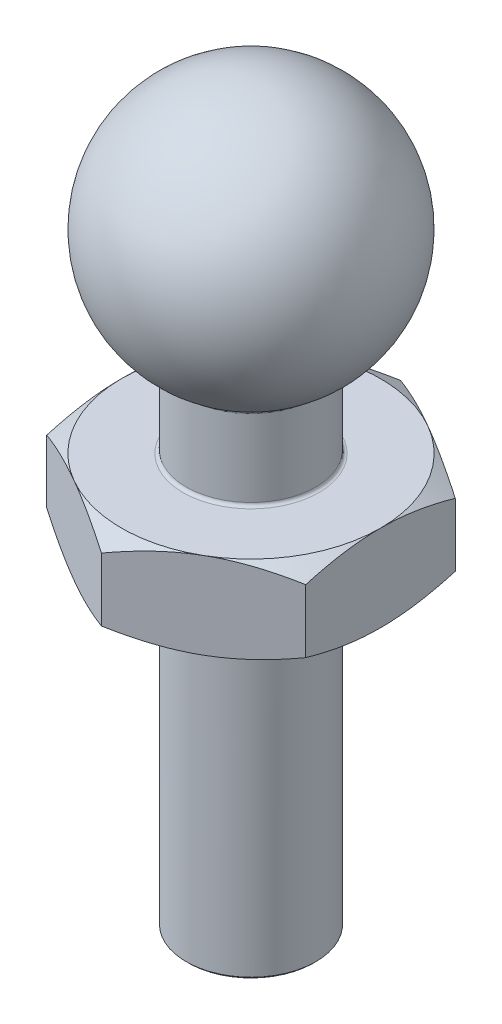
ISO-10303-21;
HEADER;
FILE_DESCRIPTION(('STEP AP214'),'2;1');
FILE_NAME('part.step','',(''),(''),'','','');
FILE_SCHEMA(('AUTOMOTIVE_DESIGN { 1 0 10303 214 1 1 1 1 }'));
ENDSEC;
DATA;
#1=APPLICATION_CONTEXT('core data for automotive mechanical design processes');
#2=APPLICATION_PROTOCOL_DEFINITION('international standard','automotive_design',2000,#1);
#3=PRODUCT_CONTEXT('',#1,'mechanical');
#4=PRODUCT('Part','Part','',(#3));
#5=PRODUCT_RELATED_PRODUCT_CATEGORY('part','',(#4));
#6=PRODUCT_DEFINITION_FORMATION('','',#4);
#7=PRODUCT_DEFINITION_CONTEXT('part definition',#1,'design');
#8=PRODUCT_DEFINITION('design','',#6,#7);
#9=PRODUCT_DEFINITION_SHAPE('','',#8);
#10=(LENGTH_UNIT() NAMED_UNIT(*) SI_UNIT(.MILLI.,.METRE.));
#11=(NAMED_UNIT(*) PLANE_ANGLE_UNIT() SI_UNIT($,.RADIAN.));
#12=(NAMED_UNIT(*) SI_UNIT($,.STERADIAN.) SOLID_ANGLE_UNIT());
#13=UNCERTAINTY_MEASURE_WITH_UNIT(LENGTH_MEASURE(1.E-05),#10,'distance_accuracy_value','');
#14=(GEOMETRIC_REPRESENTATION_CONTEXT(3) GLOBAL_UNCERTAINTY_ASSIGNED_CONTEXT((#13)) GLOBAL_UNIT_ASSIGNED_CONTEXT((#10,
#11,#12)) REPRESENTATION_CONTEXT('',''));
#15=CARTESIAN_POINT('',(0.,0.,0.));
#16=DIRECTION('',(0.,0.,1.));
#17=DIRECTION('',(1.,0.,0.));
#18=AXIS2_PLACEMENT_3D('',#15,#16,#17);
#19=CARTESIAN_POINT('',(0.,9.5,-3.46410161513776));
#20=DIRECTION('',(0.5,0.,0.866025403784439));
#21=DIRECTION('',(0.866025403784439,0.,-0.5));
#22=AXIS2_PLACEMENT_3D('',#19,#20,#21);
#23=PLANE('',#22);
#24=CARTESIAN_POINT('',(0.000200000000000843,9.23198413756899,-3.46421708519159));
#25=CARTESIAN_POINT('',(-0.131635206588331,9.27594629554769,-3.38810199317915));
#26=CARTESIAN_POINT('',(-0.264608405355248,9.31592841370737,-3.31132988107606));
#27=CARTESIAN_POINT('',(-0.532857420002055,9.38571791955454,-3.15645624025988));
#28=CARTESIAN_POINT('',(-0.668138002634341,9.41550061773462,-3.078351959461));
#29=CARTESIAN_POINT('',(-0.937022602096483,9.46186216078874,-2.92311136358059));
#30=CARTESIAN_POINT('',(-1.07058524542946,9.47874955887705,-2.84599893549861));
#31=CARTESIAN_POINT('',(-1.33833905729569,9.49891035755148,-2.6914112001411));
#32=CARTESIAN_POINT('',(-1.47252925247984,9.50220045221892,-2.61393645482892));
#33=CARTESIAN_POINT('',(-1.72327559769581,9.49535946911461,-2.46916798492017));
#34=CARTESIAN_POINT('',(-1.83986926497268,9.48690808580738,-2.40185259973206));
#35=CARTESIAN_POINT('',(-2.07229698497464,9.46012105699296,-2.2676603930218));
#36=CARTESIAN_POINT('',(-2.18813023365133,9.44177625913829,-2.2007840357172));
#37=CARTESIAN_POINT('',(-2.42103725705637,9.39591524914667,-2.06631510305815));
#38=CARTESIAN_POINT('',(-2.53808155051394,9.36820461473692,-1.99873954872331));
#39=CARTESIAN_POINT('',(-2.77042435049913,9.3053122048626,-1.86459637060759));
#40=CARTESIAN_POINT('',(-2.88572583417111,9.27014520897844,-1.79802702797161));
#41=CARTESIAN_POINT('',(-3.0002,9.23198413756899,-1.73193533751504));
#42=B_SPLINE_CURVE_WITH_KNOTS('',3,(#24,#25,#26,#27,#28,#29,#30,#31,#32,#33,#34,#35,#36,#37,#38,
#39,#40,#41),.UNSPECIFIED.,.F.,.F.,(4,2,2,2,2,2,2,2,4),(0.,0.475539830103041,0.952222784107964,
1.41710776961288,1.88142182298026,2.28572436316091,2.69040156475039,3.10405572063576,
3.5168974940707),.UNSPECIFIED.);
#43=CARTESIAN_POINT('',(0.,9.23205080756888,-3.46410161513776));
#44=VERTEX_POINT('',#43);
#45=CARTESIAN_POINT('',(-1.5,9.5,-2.59807621135332));
#46=VERTEX_POINT('',#45);
#47=EDGE_CURVE('E182',#44,#46,#42,.T.);
#48=ORIENTED_EDGE('',*,*,#47,.F.);
#49=DIRECTION('',(0.,-1.,0.));
#50=VECTOR('',#49,1.);
#51=CARTESIAN_POINT('',(0.,9.5,-3.46410161513776));
#52=LINE('',#51,#50);
#53=CARTESIAN_POINT('',(0.,7.76794919243112,-3.46410161513776));
#54=VERTEX_POINT('',#53);
#55=EDGE_CURVE('E652',#44,#54,#52,.T.);
#56=ORIENTED_EDGE('',*,*,#55,.T.);
#57=CARTESIAN_POINT('',(-3.0002,7.76801586243101,-1.73193533751504));
#58=CARTESIAN_POINT('',(-2.86836479341167,7.72405370445231,-1.80805042952748));
#59=CARTESIAN_POINT('',(-2.73539159464475,7.68407158629263,-1.88482254163057));
#60=CARTESIAN_POINT('',(-2.46714257999794,7.61428208044547,-2.03969618244675));
#61=CARTESIAN_POINT('',(-2.33186199736566,7.58449938226538,-2.11780046324563));
#62=CARTESIAN_POINT('',(-2.06297739790352,7.53813783921126,-2.27304105912605));
#63=CARTESIAN_POINT('',(-1.92941475457054,7.52125044112295,-2.35015348720802));
#64=CARTESIAN_POINT('',(-1.66166094270431,7.50108964244852,-2.50474122256553));
#65=CARTESIAN_POINT('',(-1.52747074752016,7.49779954778108,-2.58221596787771));
#66=CARTESIAN_POINT('',(-1.27672440230419,7.50464053088539,-2.72698443778646));
#67=CARTESIAN_POINT('',(-1.16013073502732,7.51309191419262,-2.79429982297457));
#68=CARTESIAN_POINT('',(-0.927703015025364,7.53987894300703,-2.92849202968483));
#69=CARTESIAN_POINT('',(-0.811869766348669,7.55822374086171,-2.99536838698943));
#70=CARTESIAN_POINT('',(-0.578962742943632,7.60408475085333,-3.12983731964848));
#71=CARTESIAN_POINT('',(-0.461918449486059,7.63179538526308,-3.19741287398332));
#72=CARTESIAN_POINT('',(-0.229575649500875,7.6946877951374,-3.33155605209904));
#73=CARTESIAN_POINT('',(-0.114274165828894,7.72985479102156,-3.39812539473502));
#74=CARTESIAN_POINT('',(0.00020000000000043,7.76801586243101,-3.46421708519159));
#75=B_SPLINE_CURVE_WITH_KNOTS('',3,(#57,#58,#59,#60,#61,#62,#63,#64,#65,#66,#67,#68,#69,#70,#71,
#72,#73,#74),.UNSPECIFIED.,.F.,.F.,(4,2,2,2,2,2,2,2,4),(0.,0.47553983010304,0.952222784107964,
1.41710776961288,1.88142182298026,2.28572436316091,2.69040156475039,3.10405572063576,
3.5168974940707),.UNSPECIFIED.);
#76=CARTESIAN_POINT('',(-1.5,7.5,-2.59807621135332));
#77=VERTEX_POINT('',#76);
#78=EDGE_CURVE('E595',#77,#54,#75,.T.);
#79=ORIENTED_EDGE('',*,*,#78,.F.);
#80=CARTESIAN_POINT('',(-3.,7.76794919243112,-1.73205080756888));
#81=VERTEX_POINT('',#80);
#82=EDGE_CURVE('E601',#81,#77,#75,.T.);
#83=ORIENTED_EDGE('',*,*,#82,.F.);
#84=DIRECTION('',(0.,-1.,0.));
#85=VECTOR('',#84,1.);
#86=CARTESIAN_POINT('',(-3.,9.5,-1.73205080756888));
#87=LINE('',#86,#85);
#88=CARTESIAN_POINT('',(-3.,9.23205080756888,-1.73205080756888));
#89=VERTEX_POINT('',#88);
#90=EDGE_CURVE('E189',#89,#81,#87,.T.);
#91=ORIENTED_EDGE('',*,*,#90,.F.);
#92=EDGE_CURVE('E174',#46,#89,#42,.T.);
#93=ORIENTED_EDGE('',*,*,#92,.F.);
#94=EDGE_LOOP('',(#48,#56,#79,#83,#91,#93));
#95=FACE_BOUND('',#94,.T.);
#96=ADVANCED_FACE('F52',(#95),#23,.F.);
#97=CARTESIAN_POINT('',(3.,9.5,-1.73205080756888));
#98=DIRECTION('',(-0.5,0.,0.866025403784439));
#99=DIRECTION('',(0.866025403784439,0.,0.5));
#100=AXIS2_PLACEMENT_3D('',#97,#98,#99);
#101=PLANE('',#100);
#102=CARTESIAN_POINT('',(3.0002,9.23198413756899,-1.73193533751504));
#103=CARTESIAN_POINT('',(2.86836479341167,9.27594629554769,-1.80805042952748));
#104=CARTESIAN_POINT('',(2.73539159464475,9.31592841370737,-1.88482254163057));
#105=CARTESIAN_POINT('',(2.46714257999794,9.38571791955453,-2.03969618244676));
#106=CARTESIAN_POINT('',(2.33186199736566,9.41550061773462,-2.11780046324564));
#107=CARTESIAN_POINT('',(2.06297739790352,9.46186216078874,-2.27304105912605));
#108=CARTESIAN_POINT('',(1.92941475457054,9.47874955887705,-2.35015348720802));
#109=CARTESIAN_POINT('',(1.66166094270431,9.49891035755148,-2.50474122256554));
#110=CARTESIAN_POINT('',(1.52747074752016,9.50220045221892,-2.58221596787771));
#111=CARTESIAN_POINT('',(1.27672440230419,9.49535946911461,-2.72698443778647));
#112=CARTESIAN_POINT('',(1.16013073502732,9.48690808580738,-2.79429982297457));
#113=CARTESIAN_POINT('',(0.927703015025364,9.46012105699296,-2.92849202968483));
#114=CARTESIAN_POINT('',(0.811869766348669,9.44177625913829,-2.99536838698943));
#115=CARTESIAN_POINT('',(0.578962742943633,9.39591524914667,-3.12983731964849));
#116=CARTESIAN_POINT('',(0.46191844948606,9.36820461473692,-3.19741287398332));
#117=CARTESIAN_POINT('',(0.229575649500876,9.3053122048626,-3.33155605209904));
#118=CARTESIAN_POINT('',(0.114274165828895,9.27014520897844,-3.39812539473502));
#119=CARTESIAN_POINT('',(-0.000199999999998858,9.23198413756899,-3.46421708519159));
#120=B_SPLINE_CURVE_WITH_KNOTS('',3,(#102,#103,#104,#105,#106,#107,#108,#109,#110,#111,#112,
#113,#114,#115,#116,#117,#118,#119),.UNSPECIFIED.,.F.,.F.,(4,2,2,2,2,2,2,2,4),(0.,
0.47553983010304,0.952222784107964,1.41710776961288,1.88142182298026,2.28572436316091,
2.69040156475039,3.10405572063576,3.5168974940707),.UNSPECIFIED.);
#121=CARTESIAN_POINT('',(3.,9.23205080756888,-1.73205080756888));
#122=VERTEX_POINT('',#121);
#123=CARTESIAN_POINT('',(1.5,9.5,-2.59807621135332));
#124=VERTEX_POINT('',#123);
#125=EDGE_CURVE('E146',#122,#124,#120,.T.);
#126=ORIENTED_EDGE('',*,*,#125,.F.);
#127=DIRECTION('',(0.,-1.,0.));
#128=VECTOR('',#127,1.);
#129=CARTESIAN_POINT('',(3.,9.5,-1.73205080756888));
#130=LINE('',#129,#128);
#131=CARTESIAN_POINT('',(3.,7.76794919243112,-1.73205080756888));
#132=VERTEX_POINT('',#131);
#133=EDGE_CURVE('E168',#122,#132,#130,.T.);
#134=ORIENTED_EDGE('',*,*,#133,.T.);
#135=CARTESIAN_POINT('',(-0.000199999999999002,7.76801586243101,-3.46421708519159));
#136=CARTESIAN_POINT('',(0.131635206588333,7.72405370445231,-3.38810199317915));
#137=CARTESIAN_POINT('',(0.26460840535525,7.68407158629263,-3.31132988107606));
#138=CARTESIAN_POINT('',(0.532857420002057,7.61428208044547,-3.15645624025988));
#139=CARTESIAN_POINT('',(0.668138002634343,7.58449938226538,-3.078351959461));
#140=CARTESIAN_POINT('',(0.937022602096484,7.53813783921126,-2.92311136358059));
#141=CARTESIAN_POINT('',(1.07058524542946,7.52125044112295,-2.84599893549861));
#142=CARTESIAN_POINT('',(1.33833905729569,7.50108964244852,-2.6914112001411));
#143=CARTESIAN_POINT('',(1.47252925247984,7.49779954778108,-2.61393645482892));
#144=CARTESIAN_POINT('',(1.72327559769581,7.50464053088539,-2.46916798492017));
#145=CARTESIAN_POINT('',(1.83986926497268,7.51309191419262,-2.40185259973206));
#146=CARTESIAN_POINT('',(2.07229698497464,7.53987894300704,-2.2676603930218));
#147=CARTESIAN_POINT('',(2.18813023365133,7.55822374086171,-2.2007840357172));
#148=CARTESIAN_POINT('',(2.42103725705637,7.60408475085333,-2.06631510305815));
#149=CARTESIAN_POINT('',(2.53808155051394,7.63179538526308,-1.99873954872331));
#150=CARTESIAN_POINT('',(2.77042435049912,7.6946877951374,-1.86459637060759));
#151=CARTESIAN_POINT('',(2.88572583417111,7.72985479102156,-1.79802702797161));
#152=CARTESIAN_POINT('',(3.0002,7.76801586243101,-1.73193533751504));
#153=B_SPLINE_CURVE_WITH_KNOTS('',3,(#135,#136,#137,#138,#139,#140,#141,#142,#143,#144,#145,
#146,#147,#148,#149,#150,#151,#152),.UNSPECIFIED.,.F.,.F.,(4,2,2,2,2,2,2,2,4),(0.,
0.475539830103041,0.952222784107964,1.41710776961288,1.88142182298026,2.28572436316091,
2.69040156475039,3.10405572063576,3.5168974940707),.UNSPECIFIED.);
#154=CARTESIAN_POINT('',(1.5,7.5,-2.59807621135332));
#155=VERTEX_POINT('',#154);
#156=EDGE_CURVE('E260',#155,#132,#153,.T.);
#157=ORIENTED_EDGE('',*,*,#156,.F.);
#158=EDGE_CURVE('E251',#54,#155,#153,.T.);
#159=ORIENTED_EDGE('',*,*,#158,.F.);
#160=ORIENTED_EDGE('',*,*,#55,.F.);
#161=EDGE_CURVE('E180',#124,#44,#120,.T.);
#162=ORIENTED_EDGE('',*,*,#161,.F.);
#163=EDGE_LOOP('',(#126,#134,#157,#159,#160,#162));
#164=FACE_BOUND('',#163,.T.);
#165=ADVANCED_FACE('F244',(#164),#101,.F.);
#166=CARTESIAN_POINT('',(3.,9.5,1.73205080756888));
#167=DIRECTION('',(-1.,0.,0.));
#168=DIRECTION('',(0.,0.,1.));
#169=AXIS2_PLACEMENT_3D('',#166,#167,#168);
#170=PLANE('',#169);
#171=CARTESIAN_POINT('',(3.,7.49669275597267,5.73225080756888));
#172=CARTESIAN_POINT('',(3.,7.56535762873895,5.59799811373668));
#173=CARTESIAN_POINT('',(3.,7.63362658074956,5.46354106552017));
#174=CARTESIAN_POINT('',(3.,7.7691751977503,5.19412594711895));
#175=CARTESIAN_POINT('',(3.,7.83645484167597,5.05916786634262));
#176=CARTESIAN_POINT('',(3.,7.96993872408742,4.78843231789163));
#177=CARTESIAN_POINT('',(3.,8.0361409223391,4.65265384244874));
#178=CARTESIAN_POINT('',(3.,8.16708055525372,4.38038885038151));
#179=CARTESIAN_POINT('',(3.,8.23181796851999,4.24390232345014));
#180=CARTESIAN_POINT('',(3.,8.36273075239076,3.96310511366176));
#181=CARTESIAN_POINT('',(3.,8.42881132731156,3.81875010473635));
#182=CARTESIAN_POINT('',(3.,8.55842928727965,3.52890389215656));
#183=CARTESIAN_POINT('',(3.,8.62196674541402,3.38341272129836));
#184=CARTESIAN_POINT('',(3.,8.74573518476893,3.0911428032025));
#185=CARTESIAN_POINT('',(3.,8.80596844827942,2.94436502804428));
#186=CARTESIAN_POINT('',(3.,8.92221294586851,2.64909731827644));
#187=CARTESIAN_POINT('',(3.,8.97822314680859,2.50060697487877));
#188=CARTESIAN_POINT('',(3.,9.09420348606466,2.17495473766773));
#189=CARTESIAN_POINT('',(3.,9.15309774811247,1.99740334689548));
#190=CARTESIAN_POINT('',(3.,9.26029523419006,1.63917764376158));
#191=CARTESIAN_POINT('',(3.,9.30860404614459,1.45850503366086));
#192=CARTESIAN_POINT('',(3.,9.39023263279609,1.09720914532956));
#193=CARTESIAN_POINT('',(3.,9.42381477693698,0.916647599895755));
#194=CARTESIAN_POINT('',(3.,9.46126742176692,0.644079261802785));
#195=CARTESIAN_POINT('',(3.,9.47159787377878,0.552943422867091));
#196=CARTESIAN_POINT('',(3.,9.48763454600052,0.370270654947725));
#197=CARTESIAN_POINT('',(3.,9.49334144079801,0.278733786435307));
#198=CARTESIAN_POINT('',(3.,9.49996614854262,0.0944078517722059));
#199=CARTESIAN_POINT('',(3.,9.50082686163439,0.00161671746075736));
#200=CARTESIAN_POINT('',(3.,9.49757525562797,-0.183877598413803));
#201=CARTESIAN_POINT('',(3.,9.49346292019229,-0.276580779686971));
#202=CARTESIAN_POINT('',(3.,9.48041370767168,-0.461668088480517));
#203=CARTESIAN_POINT('',(3.,9.47147558711607,-0.554052127589445));
#204=CARTESIAN_POINT('',(3.,9.4490819835307,-0.738276464049776));
#205=CARTESIAN_POINT('',(3.,9.43562578745626,-0.830116673244046));
#206=CARTESIAN_POINT('',(3.,9.38848678345653,-1.1081241349506));
#207=CARTESIAN_POINT('',(3.,9.34831083516922,-1.29320289274649));
#208=CARTESIAN_POINT('',(3.,9.25483304091392,-1.65992833453579));
#209=CARTESIAN_POINT('',(3.,9.2015281748169,-1.8415742184766));
#210=CARTESIAN_POINT('',(3.,9.09001482170302,-2.18718321983853));
#211=CARTESIAN_POINT('',(3.,9.03254960886738,-2.35139002090274));
#212=CARTESIAN_POINT('',(3.,8.91157770593576,-2.67757637701536));
#213=CARTESIAN_POINT('',(3.,8.84806982210383,-2.83955548471668));
#214=CARTESIAN_POINT('',(3.,8.71649668995848,-3.16180541641892));
#215=CARTESIAN_POINT('',(3.,8.64842746398322,-3.32207460435457));
#216=CARTESIAN_POINT('',(3.,8.50888164672137,-3.64112437712565));
#217=CARTESIAN_POINT('',(3.,8.43740489080743,-3.79990488959462));
#218=CARTESIAN_POINT('',(3.,8.29572041514807,-4.10783154121877));
#219=CARTESIAN_POINT('',(3.,8.22564804300012,-4.25704019529893));
#220=CARTESIAN_POINT('',(3.,8.0836551872923,-4.55457880885657));
#221=CARTESIAN_POINT('',(3.,8.01173465191385,-4.70290874355283));
#222=CARTESIAN_POINT('',(3.,7.86663085724281,-4.99841900754648));
#223=CARTESIAN_POINT('',(3.,7.79345182235509,-5.14560141584992));
#224=CARTESIAN_POINT('',(3.,7.64590152942626,-5.43935321353677));
#225=CARTESIAN_POINT('',(3.,7.57153036655204,-5.58592265068707));
#226=CARTESIAN_POINT('',(3.,7.49669275597267,-5.73225080756888));
#227=B_SPLINE_CURVE_WITH_KNOTS('',3,(#171,#172,#173,#174,#175,#176,#177,#178,#179,#180,#181,
#182,#183,#184,#185,#186,#187,#188,#189,#190,#191,#192,#193,#194,#195,#196,#197,#198,#199,#200,
#201,#202,#203,#204,#205,#206,#207,#208,#209,#210,#211,#212,#213,#214,#215,#216,#217,#218,#219,
#220,#221,#222,#223,#224,#225,#226),.UNSPECIFIED.,.F.,.F.,(4,2,2,2,2,2,2,2,2,2,2,2,2,2,2,2,2,2,
2,2,2,2,2,2,2,2,2,4),(0.,0.452382016001322,0.904773650265348,1.35794045354517,1.81111387213612,
2.2873771437625,2.76362671813267,3.23954308217786,3.71557550010852,4.27652369616462,
4.83717505756687,5.38738613645124,5.66244417939779,5.937462083513,6.21571369559986,
6.4939662218021,6.77229048018743,7.05065868449287,7.61810965270507,8.18569127741243,
8.70745206667821,9.2293161451901,9.75164138486645,10.2739918851653,10.7685068932809,
11.2630357817083,11.756143015984,12.2492110799155),.UNSPECIFIED.);
#228=CARTESIAN_POINT('',(3.,9.23205080756888,1.73205080756888));
#229=VERTEX_POINT('',#228);
#230=CARTESIAN_POINT('',(3.,9.5,0.));
#231=VERTEX_POINT('',#230);
#232=EDGE_CURVE('E157',#229,#231,#227,.T.);
#233=ORIENTED_EDGE('',*,*,#232,.F.);
#234=DIRECTION('',(0.,-1.,0.));
#235=VECTOR('',#234,1.);
#236=CARTESIAN_POINT('',(3.,9.5,1.73205080756888));
#237=LINE('',#236,#235);
#238=CARTESIAN_POINT('',(3.,7.7679491924311,1.73205080756891));
#239=VERTEX_POINT('',#238);
#240=EDGE_CURVE('E584',#229,#239,#237,.T.);
#241=ORIENTED_EDGE('',*,*,#240,.T.);
#242=CARTESIAN_POINT('',(3.,9.50330724402733,-5.73225080756888));
#243=CARTESIAN_POINT('',(3.,9.43464237126105,-5.59799811373669));
#244=CARTESIAN_POINT('',(3.,9.36637341925044,-5.46354106552017));
#245=CARTESIAN_POINT('',(3.,9.2308248022497,-5.19412594711896));
#246=CARTESIAN_POINT('',(3.,9.16354515832403,-5.05916786634262));
#247=CARTESIAN_POINT('',(3.,9.03006127591258,-4.78843231789163));
#248=CARTESIAN_POINT('',(3.,8.9638590776609,-4.65265384244875));
#249=CARTESIAN_POINT('',(3.,8.83291944474628,-4.38038885038152));
#250=CARTESIAN_POINT('',(3.,8.76818203148001,-4.24390232345015));
#251=CARTESIAN_POINT('',(3.,8.63726924760924,-3.96310511366176));
#252=CARTESIAN_POINT('',(3.,8.57118867268844,-3.81875010473635));
#253=CARTESIAN_POINT('',(3.,8.44157071272035,-3.52890389215656));
#254=CARTESIAN_POINT('',(3.,8.37803325458598,-3.38341272129836));
#255=CARTESIAN_POINT('',(3.,8.25426481523107,-3.0911428032025));
#256=CARTESIAN_POINT('',(3.,8.19403155172058,-2.94436502804428));
#257=CARTESIAN_POINT('',(3.,8.07778705413149,-2.64909731827644));
#258=CARTESIAN_POINT('',(3.,8.02177685319141,-2.50060697487877));
#259=CARTESIAN_POINT('',(3.,7.90579651393534,-2.17495473766773));
#260=CARTESIAN_POINT('',(3.,7.84690225188754,-1.99740334689548));
#261=CARTESIAN_POINT('',(3.,7.73970476580994,-1.63917764376158));
#262=CARTESIAN_POINT('',(3.,7.69139595385541,-1.45850503366086));
#263=CARTESIAN_POINT('',(3.,7.60976736720391,-1.09720914532956));
#264=CARTESIAN_POINT('',(3.,7.57618522306302,-0.916647599895756));
#265=CARTESIAN_POINT('',(3.,7.53873257823308,-0.644079261802786));
#266=CARTESIAN_POINT('',(3.,7.52840212622122,-0.552943422867092));
#267=CARTESIAN_POINT('',(3.,7.51236545399948,-0.370270654947725));
#268=CARTESIAN_POINT('',(3.,7.50665855920199,-0.278733786435307));
#269=CARTESIAN_POINT('',(3.,7.50003385145738,-0.0944078517722058));
#270=CARTESIAN_POINT('',(3.,7.4991731383656,-0.00161671746075726));
#271=CARTESIAN_POINT('',(3.,7.50242474437203,0.183877598413804));
#272=CARTESIAN_POINT('',(3.,7.50653707980771,0.276580779686971));
#273=CARTESIAN_POINT('',(3.,7.51958629232832,0.461668088480518));
#274=CARTESIAN_POINT('',(3.,7.52852441288393,0.554052127589446));
#275=CARTESIAN_POINT('',(3.,7.5509180164693,0.738276464049776));
#276=CARTESIAN_POINT('',(3.,7.56437421254374,0.830116673244046));
#277=CARTESIAN_POINT('',(3.,7.61151321654347,1.1081241349506));
#278=CARTESIAN_POINT('',(3.,7.65168916483078,1.2932028927465));
#279=CARTESIAN_POINT('',(3.,7.74516695908608,1.65992833453579));
#280=CARTESIAN_POINT('',(3.,7.7984718251831,1.8415742184766));
#281=CARTESIAN_POINT('',(3.,7.90998517829698,2.18718321983853));
#282=CARTESIAN_POINT('',(3.,7.96745039113262,2.35139002090274));
#283=CARTESIAN_POINT('',(3.,8.08842229406423,2.67757637701536));
#284=CARTESIAN_POINT('',(3.,8.15193017789617,2.83955548471668));
#285=CARTESIAN_POINT('',(3.,8.28350331004152,3.16180541641892));
#286=CARTESIAN_POINT('',(3.,8.35157253601678,3.32207460435457));
#287=CARTESIAN_POINT('',(3.,8.49111835327863,3.64112437712565));
#288=CARTESIAN_POINT('',(3.,8.56259510919257,3.79990488959462));
#289=CARTESIAN_POINT('',(3.,8.70427958485193,4.10783154121877));
#290=CARTESIAN_POINT('',(3.,8.77435195699987,4.25704019529893));
#291=CARTESIAN_POINT('',(3.,8.9163448127077,4.55457880885657));
#292=CARTESIAN_POINT('',(3.,8.98826534808615,4.70290874355283));
#293=CARTESIAN_POINT('',(3.,9.13336914275719,4.99841900754647));
#294=CARTESIAN_POINT('',(3.,9.20654817764491,5.14560141584992));
#295=CARTESIAN_POINT('',(3.,9.35409847057374,5.43935321353677));
#296=CARTESIAN_POINT('',(3.,9.42846963344796,5.58592265068707));
#297=CARTESIAN_POINT('',(3.,9.50330724402733,5.73225080756888));
#298=B_SPLINE_CURVE_WITH_KNOTS('',3,(#242,#243,#244,#245,#246,#247,#248,#249,#250,#251,#252,
#253,#254,#255,#256,#257,#258,#259,#260,#261,#262,#263,#264,#265,#266,#267,#268,#269,#270,#271,
#272,#273,#274,#275,#276,#277,#278,#279,#280,#281,#282,#283,#284,#285,#286,#287,#288,#289,#290,
#291,#292,#293,#294,#295,#296,#297),.UNSPECIFIED.,.F.,.F.,(4,2,2,2,2,2,2,2,2,2,2,2,2,2,2,2,2,2,
2,2,2,2,2,2,2,2,2,4),(0.,0.452382016001322,0.904773650265347,1.35794045354517,1.81111387213612,
2.2873771437625,2.76362671813268,3.23954308217786,3.71557550010852,4.27652369616462,
4.83717505756687,5.38738613645125,5.66244417939779,5.93746208351301,6.21571369559987,
6.4939662218021,6.77229048018743,7.05065868449288,7.61810965270508,8.18569127741244,
8.70745206667822,9.2293161451901,9.75164138486645,10.2739918851653,10.7685068932809,
11.2630357817083,11.756143015984,12.2492110799155),.UNSPECIFIED.);
#299=CARTESIAN_POINT('',(3.,7.5,0.));
#300=VERTEX_POINT('',#299);
#301=EDGE_CURVE('E628',#300,#239,#298,.T.);
#302=ORIENTED_EDGE('',*,*,#301,.F.);
#303=EDGE_CURVE('E268',#132,#300,#298,.T.);
#304=ORIENTED_EDGE('',*,*,#303,.F.);
#305=ORIENTED_EDGE('',*,*,#133,.F.);
#306=EDGE_CURVE('E144',#231,#122,#227,.T.);
#307=ORIENTED_EDGE('',*,*,#306,.F.);
#308=EDGE_LOOP('',(#233,#241,#302,#304,#305,#307));
#309=FACE_BOUND('',#308,.T.);
#310=ADVANCED_FACE('F166',(#309),#170,.F.);
#311=CARTESIAN_POINT('',(0.,9.5,3.46410161513775));
#312=DIRECTION('',(-0.5,0.,-0.866025403784439));
#313=DIRECTION('',(-0.866025403784439,0.,0.5));
#314=AXIS2_PLACEMENT_3D('',#311,#312,#313);
#315=PLANE('',#314);
#316=CARTESIAN_POINT('',(-0.000200000000000103,9.23198413756899,3.46421708519159));
#317=CARTESIAN_POINT('',(0.131635206588331,9.27594629554769,3.38810199317915));
#318=CARTESIAN_POINT('',(0.264608405355249,9.31592841370737,3.31132988107606));
#319=CARTESIAN_POINT('',(0.532857420002055,9.38571791955454,3.15645624025988));
#320=CARTESIAN_POINT('',(0.668138002634341,9.41550061773462,3.078351959461));
#321=CARTESIAN_POINT('',(0.937022602096483,9.46186216078874,2.92311136358059));
#322=CARTESIAN_POINT('',(1.07058524542946,9.47874955887705,2.84599893549861));
#323=CARTESIAN_POINT('',(1.33833905729569,9.49891035755148,2.6914112001411));
#324=CARTESIAN_POINT('',(1.47252925247984,9.50220045221892,2.61393645482892));
#325=CARTESIAN_POINT('',(1.72327559769581,9.49535946911461,2.46916798492017));
#326=CARTESIAN_POINT('',(1.83986926497268,9.48690808580738,2.40185259973206));
#327=CARTESIAN_POINT('',(2.07229698497464,9.46012105699297,2.2676603930218));
#328=CARTESIAN_POINT('',(2.18813023365133,9.44177625913829,2.2007840357172));
#329=CARTESIAN_POINT('',(2.42103725705637,9.39591524914667,2.06631510305815));
#330=CARTESIAN_POINT('',(2.53808155051394,9.36820461473692,1.99873954872331));
#331=CARTESIAN_POINT('',(2.77042435049912,9.3053122048626,1.86459637060759));
#332=CARTESIAN_POINT('',(2.88572583417111,9.27014520897844,1.79802702797161));
#333=CARTESIAN_POINT('',(3.0002,9.23198413756899,1.73193533751504));
#334=B_SPLINE_CURVE_WITH_KNOTS('',3,(#316,#317,#318,#319,#320,#321,#322,#323,#324,#325,#326,
#327,#328,#329,#330,#331,#332,#333),.UNSPECIFIED.,.F.,.F.,(4,2,2,2,2,2,2,2,4),(0.,
0.47553983010304,0.952222784107964,1.41710776961288,1.88142182298026,2.28572436316091,
2.69040156475039,3.10405572063576,3.5168974940707),.UNSPECIFIED.);
#335=CARTESIAN_POINT('',(0.,9.23205080756888,3.46410161513775));
#336=VERTEX_POINT('',#335);
#337=CARTESIAN_POINT('',(1.5,9.5,2.59807621135332));
#338=VERTEX_POINT('',#337);
#339=EDGE_CURVE('E202',#336,#338,#334,.T.);
#340=ORIENTED_EDGE('',*,*,#339,.F.);
#341=DIRECTION('',(0.,-1.,0.));
#342=VECTOR('',#341,1.);
#343=CARTESIAN_POINT('',(0.,9.5,3.46410161513775));
#344=LINE('',#343,#342);
#345=CARTESIAN_POINT('',(0.,7.76794919243112,3.46410161513775));
#346=VERTEX_POINT('',#345);
#347=EDGE_CURVE('E577',#336,#346,#344,.T.);
#348=ORIENTED_EDGE('',*,*,#347,.T.);
#349=CARTESIAN_POINT('',(3.0002,7.76801586243101,1.73193533751504));
#350=CARTESIAN_POINT('',(2.86836479341167,7.7240537044523,1.80805042952748));
#351=CARTESIAN_POINT('',(2.73539159464475,7.68407158629263,1.88482254163057));
#352=CARTESIAN_POINT('',(2.46714257999794,7.61428208044547,2.03969618244675));
#353=CARTESIAN_POINT('',(2.33186199736566,7.58449938226538,2.11780046324563));
#354=CARTESIAN_POINT('',(2.06297739790352,7.53813783921126,2.27304105912604));
#355=CARTESIAN_POINT('',(1.92941475457054,7.52125044112295,2.35015348720802));
#356=CARTESIAN_POINT('',(1.66166094270431,7.50108964244852,2.50474122256553));
#357=CARTESIAN_POINT('',(1.52747074752016,7.49779954778108,2.58221596787771));
#358=CARTESIAN_POINT('',(1.27672440230419,7.50464053088539,2.72698443778646));
#359=CARTESIAN_POINT('',(1.16013073502733,7.51309191419262,2.79429982297457));
#360=CARTESIAN_POINT('',(0.927703015025365,7.53987894300703,2.92849202968483));
#361=CARTESIAN_POINT('',(0.81186976634867,7.55822374086171,2.99536838698943));
#362=CARTESIAN_POINT('',(0.578962742943633,7.60408475085333,3.12983731964848));
#363=CARTESIAN_POINT('',(0.46191844948606,7.63179538526308,3.19741287398332));
#364=CARTESIAN_POINT('',(0.229575649500875,7.6946877951374,3.33155605209904));
#365=CARTESIAN_POINT('',(0.114274165828893,7.72985479102156,3.39812539473502));
#366=CARTESIAN_POINT('',(-0.000200000000000169,7.76801586243101,3.46421708519159));
#367=B_SPLINE_CURVE_WITH_KNOTS('',3,(#349,#350,#351,#352,#353,#354,#355,#356,#357,#358,#359,
#360,#361,#362,#363,#364,#365,#366),.UNSPECIFIED.,.F.,.F.,(4,2,2,2,2,2,2,2,4),(0.,
0.47553983010304,0.952222784107963,1.41710776961288,1.88142182298026,2.28572436316091,
2.69040156475039,3.10405572063576,3.5168974940707),.UNSPECIFIED.);
#368=CARTESIAN_POINT('',(1.5,7.5,2.59807621135332));
#369=VERTEX_POINT('',#368);
#370=EDGE_CURVE('E631',#369,#346,#367,.T.);
#371=ORIENTED_EDGE('',*,*,#370,.F.);
#372=EDGE_CURVE('E634',#239,#369,#367,.T.);
#373=ORIENTED_EDGE('',*,*,#372,.F.);
#374=ORIENTED_EDGE('',*,*,#240,.F.);
#375=EDGE_CURVE('E160',#338,#229,#334,.T.);
#376=ORIENTED_EDGE('',*,*,#375,.F.);
#377=EDGE_LOOP('',(#340,#348,#371,#373,#374,#376));
#378=FACE_BOUND('',#377,.T.);
#379=ADVANCED_FACE('F328',(#378),#315,.F.);
#380=CARTESIAN_POINT('',(-3.,9.5,1.73205080756888));
#381=DIRECTION('',(0.5,0.,-0.866025403784439));
#382=DIRECTION('',(-0.866025403784439,0.,-0.5));
#383=AXIS2_PLACEMENT_3D('',#380,#381,#382);
#384=PLANE('',#383);
#385=CARTESIAN_POINT('',(-3.0002,9.23198413756899,1.73193533751504));
#386=CARTESIAN_POINT('',(-2.86836479341167,9.27594629554769,1.80805042952748));
#387=CARTESIAN_POINT('',(-2.73539159464475,9.31592841370737,1.88482254163057));
#388=CARTESIAN_POINT('',(-2.46714257999794,9.38571791955454,2.03969618244675));
#389=CARTESIAN_POINT('',(-2.33186199736566,9.41550061773462,2.11780046324563));
#390=CARTESIAN_POINT('',(-2.06297739790352,9.46186216078874,2.27304105912604));
#391=CARTESIAN_POINT('',(-1.92941475457054,9.47874955887705,2.35015348720802));
#392=CARTESIAN_POINT('',(-1.66166094270431,9.49891035755148,2.50474122256553));
#393=CARTESIAN_POINT('',(-1.52747074752016,9.50220045221892,2.58221596787771));
#394=CARTESIAN_POINT('',(-1.27672440230419,9.49535946911461,2.72698443778646));
#395=CARTESIAN_POINT('',(-1.16013073502732,9.48690808580738,2.79429982297457));
#396=CARTESIAN_POINT('',(-0.927703015025363,9.46012105699297,2.92849202968483));
#397=CARTESIAN_POINT('',(-0.811869766348668,9.44177625913829,2.99536838698943));
#398=CARTESIAN_POINT('',(-0.578962742943632,9.39591524914667,3.12983731964848));
#399=CARTESIAN_POINT('',(-0.461918449486059,9.36820461473692,3.19741287398332));
#400=CARTESIAN_POINT('',(-0.229575649500875,9.3053122048626,3.33155605209904));
#401=CARTESIAN_POINT('',(-0.114274165828893,9.27014520897844,3.39812539473502));
#402=CARTESIAN_POINT('',(0.000200000000000378,9.23198413756899,3.46421708519159));
#403=B_SPLINE_CURVE_WITH_KNOTS('',3,(#385,#386,#387,#388,#389,#390,#391,#392,#393,#394,#395,
#396,#397,#398,#399,#400,#401,#402),.UNSPECIFIED.,.F.,.F.,(4,2,2,2,2,2,2,2,4),(0.,
0.475539830103041,0.952222784107964,1.41710776961288,1.88142182298026,2.28572436316091,
2.69040156475039,3.10405572063576,3.5168974940707),.UNSPECIFIED.);
#404=CARTESIAN_POINT('',(-3.,9.2320508075689,1.73205080756891));
#405=VERTEX_POINT('',#404);
#406=CARTESIAN_POINT('',(-1.5,9.5,2.59807621135332));
#407=VERTEX_POINT('',#406);
#408=EDGE_CURVE('E172',#405,#407,#403,.T.);
#409=ORIENTED_EDGE('',*,*,#408,.F.);
#410=DIRECTION('',(0.,-1.,0.));
#411=VECTOR('',#410,1.);
#412=CARTESIAN_POINT('',(-3.,9.5,1.73205080756888));
#413=LINE('',#412,#411);
#414=CARTESIAN_POINT('',(-3.,7.76794919243112,1.73205080756888));
#415=VERTEX_POINT('',#414);
#416=EDGE_CURVE('E583',#405,#415,#413,.T.);
#417=ORIENTED_EDGE('',*,*,#416,.T.);
#418=CARTESIAN_POINT('',(0.00019999999999996,7.76801586243101,3.46421708519159));
#419=CARTESIAN_POINT('',(-0.131635206588332,7.7240537044523,3.38810199317915));
#420=CARTESIAN_POINT('',(-0.264608405355249,7.68407158629263,3.31132988107606));
#421=CARTESIAN_POINT('',(-0.532857420002056,7.61428208044546,3.15645624025988));
#422=CARTESIAN_POINT('',(-0.668138002634341,7.58449938226538,3.078351959461));
#423=CARTESIAN_POINT('',(-0.937022602096483,7.53813783921126,2.92311136358059));
#424=CARTESIAN_POINT('',(-1.07058524542946,7.52125044112295,2.84599893549861));
#425=CARTESIAN_POINT('',(-1.33833905729569,7.50108964244852,2.6914112001411));
#426=CARTESIAN_POINT('',(-1.47252925247984,7.49779954778108,2.61393645482892));
#427=CARTESIAN_POINT('',(-1.72327559769581,7.50464053088539,2.46916798492017));
#428=CARTESIAN_POINT('',(-1.83986926497268,7.51309191419262,2.40185259973206));
#429=CARTESIAN_POINT('',(-2.07229698497464,7.53987894300703,2.2676603930218));
#430=CARTESIAN_POINT('',(-2.18813023365133,7.55822374086171,2.2007840357172));
#431=CARTESIAN_POINT('',(-2.42103725705637,7.60408475085333,2.06631510305815));
#432=CARTESIAN_POINT('',(-2.53808155051394,7.63179538526308,1.99873954872331));
#433=CARTESIAN_POINT('',(-2.77042435049912,7.6946877951374,1.86459637060759));
#434=CARTESIAN_POINT('',(-2.88572583417111,7.72985479102156,1.79802702797161));
#435=CARTESIAN_POINT('',(-3.0002,7.76801586243101,1.73193533751504));
#436=B_SPLINE_CURVE_WITH_KNOTS('',3,(#418,#419,#420,#421,#422,#423,#424,#425,#426,#427,#428,
#429,#430,#431,#432,#433,#434,#435),.UNSPECIFIED.,.F.,.F.,(4,2,2,2,2,2,2,2,4),(0.,
0.475539830103041,0.952222784107964,1.41710776961288,1.88142182298026,2.28572436316091,
2.69040156475039,3.10405572063576,3.5168974940707),.UNSPECIFIED.);
#437=CARTESIAN_POINT('',(-1.5,7.5,2.59807621135332));
#438=VERTEX_POINT('',#437);
#439=EDGE_CURVE('E627',#438,#415,#436,.T.);
#440=ORIENTED_EDGE('',*,*,#439,.F.);
#441=EDGE_CURVE('E582',#346,#438,#436,.T.);
#442=ORIENTED_EDGE('',*,*,#441,.F.);
#443=ORIENTED_EDGE('',*,*,#347,.F.);
#444=EDGE_CURVE('E176',#407,#336,#403,.T.);
#445=ORIENTED_EDGE('',*,*,#444,.F.);
#446=EDGE_LOOP('',(#409,#417,#440,#442,#443,#445));
#447=FACE_BOUND('',#446,.T.);
#448=ADVANCED_FACE('F279',(#447),#384,.F.);
#449=CARTESIAN_POINT('',(-3.,9.5,-1.73205080756888));
#450=DIRECTION('',(1.,0.,0.));
#451=DIRECTION('',(0.,0.,-1.));
#452=AXIS2_PLACEMENT_3D('',#449,#450,#451);
#453=PLANE('',#452);
#454=CARTESIAN_POINT('',(-3.,7.49669275597267,-5.73225080756888));
#455=CARTESIAN_POINT('',(-3.,7.56535762873895,-5.59799811373669));
#456=CARTESIAN_POINT('',(-3.,7.63362658074956,-5.46354106552017));
#457=CARTESIAN_POINT('',(-3.,7.7691751977503,-5.19412594711895));
#458=CARTESIAN_POINT('',(-3.,7.83645484167597,-5.05916786634262));
#459=CARTESIAN_POINT('',(-3.,7.96993872408742,-4.78843231789163));
#460=CARTESIAN_POINT('',(-3.,8.0361409223391,-4.65265384244874));
#461=CARTESIAN_POINT('',(-3.,8.16708055525372,-4.38038885038151));
#462=CARTESIAN_POINT('',(-3.,8.23181796851999,-4.24390232345014));
#463=CARTESIAN_POINT('',(-3.,8.36273075239076,-3.96310511366176));
#464=CARTESIAN_POINT('',(-3.,8.42881132731156,-3.81875010473635));
#465=CARTESIAN_POINT('',(-3.,8.55842928727965,-3.52890389215656));
#466=CARTESIAN_POINT('',(-3.,8.62196674541402,-3.38341272129836));
#467=CARTESIAN_POINT('',(-3.,8.74573518476893,-3.0911428032025));
#468=CARTESIAN_POINT('',(-3.,8.80596844827941,-2.94436502804428));
#469=CARTESIAN_POINT('',(-3.,8.92221294586851,-2.64909731827644));
#470=CARTESIAN_POINT('',(-3.,8.97822314680859,-2.50060697487877));
#471=CARTESIAN_POINT('',(-3.,9.09420348606466,-2.17495473766773));
#472=CARTESIAN_POINT('',(-3.,9.15309774811247,-1.99740334689548));
#473=CARTESIAN_POINT('',(-3.,9.26029523419006,-1.63917764376158));
#474=CARTESIAN_POINT('',(-3.,9.30860404614459,-1.45850503366086));
#475=CARTESIAN_POINT('',(-3.,9.39023263279609,-1.09720914532956));
#476=CARTESIAN_POINT('',(-3.,9.42381477693698,-0.916647599895756));
#477=CARTESIAN_POINT('',(-3.,9.46126742176692,-0.644079261802786));
#478=CARTESIAN_POINT('',(-3.,9.47159787377878,-0.552943422867093));
#479=CARTESIAN_POINT('',(-3.,9.48763454600052,-0.370270654947726));
#480=CARTESIAN_POINT('',(-3.,9.49334144079801,-0.278733786435308));
#481=CARTESIAN_POINT('',(-3.,9.49996614854262,-0.0944078517722066));
#482=CARTESIAN_POINT('',(-3.,9.50082686163439,-0.0016167174607581));
#483=CARTESIAN_POINT('',(-3.,9.49757525562797,0.183877598413803));
#484=CARTESIAN_POINT('',(-3.,9.49346292019229,0.27658077968697));
#485=CARTESIAN_POINT('',(-3.,9.48041370767168,0.461668088480516));
#486=CARTESIAN_POINT('',(-3.,9.47147558711607,0.554052127589445));
#487=CARTESIAN_POINT('',(-3.,9.4490819835307,0.738276464049775));
#488=CARTESIAN_POINT('',(-3.,9.43562578745626,0.830116673244045));
#489=CARTESIAN_POINT('',(-3.,9.38848678345653,1.1081241349506));
#490=CARTESIAN_POINT('',(-3.,9.34831083516922,1.29320289274649));
#491=CARTESIAN_POINT('',(-3.,9.25483304091392,1.65992833453579));
#492=CARTESIAN_POINT('',(-3.,9.2015281748169,1.8415742184766));
#493=CARTESIAN_POINT('',(-3.,9.09001482170302,2.18718321983853));
#494=CARTESIAN_POINT('',(-3.,9.03254960886738,2.35139002090274));
#495=CARTESIAN_POINT('',(-3.,8.91157770593576,2.67757637701536));
#496=CARTESIAN_POINT('',(-3.,8.84806982210383,2.83955548471668));
#497=CARTESIAN_POINT('',(-3.,8.71649668995848,3.16180541641892));
#498=CARTESIAN_POINT('',(-3.,8.64842746398323,3.32207460435457));
#499=CARTESIAN_POINT('',(-3.,8.50888164672137,3.64112437712565));
#500=CARTESIAN_POINT('',(-3.,8.43740489080743,3.79990488959462));
#501=CARTESIAN_POINT('',(-3.,8.29572041514807,4.10783154121877));
#502=CARTESIAN_POINT('',(-3.,8.22564804300012,4.25704019529893));
#503=CARTESIAN_POINT('',(-3.,8.0836551872923,4.55457880885657));
#504=CARTESIAN_POINT('',(-3.,8.01173465191385,4.70290874355283));
#505=CARTESIAN_POINT('',(-3.,7.86663085724281,4.99841900754647));
#506=CARTESIAN_POINT('',(-3.,7.79345182235509,5.14560141584992));
#507=CARTESIAN_POINT('',(-3.,7.64590152942626,5.43935321353677));
#508=CARTESIAN_POINT('',(-3.,7.57153036655204,5.58592265068707));
#509=CARTESIAN_POINT('',(-3.,7.49669275597267,5.73225080756888));
#510=B_SPLINE_CURVE_WITH_KNOTS('',3,(#454,#455,#456,#457,#458,#459,#460,#461,#462,#463,#464,
#465,#466,#467,#468,#469,#470,#471,#472,#473,#474,#475,#476,#477,#478,#479,#480,#481,#482,#483,
#484,#485,#486,#487,#488,#489,#490,#491,#492,#493,#494,#495,#496,#497,#498,#499,#500,#501,#502,
#503,#504,#505,#506,#507,#508,#509),.UNSPECIFIED.,.F.,.F.,(4,2,2,2,2,2,2,2,2,2,2,2,2,2,2,2,2,2,
2,2,2,2,2,2,2,2,2,4),(0.,0.452382016001322,0.904773650265348,1.35794045354517,1.81111387213612,
2.2873771437625,2.76362671813267,3.23954308217786,3.71557550010852,4.27652369616462,
4.83717505756687,5.38738613645124,5.66244417939779,5.937462083513,6.21571369559986,
6.4939662218021,6.77229048018743,7.05065868449287,7.61810965270507,8.18569127741243,
8.70745206667822,9.2293161451901,9.75164138486645,10.2739918851653,10.7685068932809,
11.2630357817083,11.756143015984,12.2492110799155),.UNSPECIFIED.);
#511=CARTESIAN_POINT('',(-3.,9.5,0.));
#512=VERTEX_POINT('',#511);
#513=EDGE_CURVE('E71',#89,#512,#510,.T.);
#514=ORIENTED_EDGE('',*,*,#513,.F.);
#515=ORIENTED_EDGE('',*,*,#90,.T.);
#516=CARTESIAN_POINT('',(-3.,9.50330724402733,5.73225080756888));
#517=CARTESIAN_POINT('',(-3.,9.43464237126105,5.59799811373668));
#518=CARTESIAN_POINT('',(-3.,9.36637341925044,5.46354106552017));
#519=CARTESIAN_POINT('',(-3.,9.23082480224969,5.19412594711895));
#520=CARTESIAN_POINT('',(-3.,9.16354515832403,5.05916786634262));
#521=CARTESIAN_POINT('',(-3.,9.03006127591258,4.78843231789163));
#522=CARTESIAN_POINT('',(-3.,8.9638590776609,4.65265384244874));
#523=CARTESIAN_POINT('',(-3.,8.83291944474628,4.38038885038151));
#524=CARTESIAN_POINT('',(-3.,8.76818203148001,4.24390232345014));
#525=CARTESIAN_POINT('',(-3.,8.63726924760924,3.96310511366176));
#526=CARTESIAN_POINT('',(-3.,8.57118867268844,3.81875010473635));
#527=CARTESIAN_POINT('',(-3.,8.44157071272035,3.52890389215656));
#528=CARTESIAN_POINT('',(-3.,8.37803325458598,3.38341272129836));
#529=CARTESIAN_POINT('',(-3.,8.25426481523107,3.0911428032025));
#530=CARTESIAN_POINT('',(-3.,8.19403155172058,2.94436502804428));
#531=CARTESIAN_POINT('',(-3.,8.07778705413149,2.64909731827644));
#532=CARTESIAN_POINT('',(-3.,8.02177685319141,2.50060697487877));
#533=CARTESIAN_POINT('',(-3.,7.90579651393534,2.17495473766773));
#534=CARTESIAN_POINT('',(-3.,7.84690225188754,1.99740334689548));
#535=CARTESIAN_POINT('',(-3.,7.73970476580994,1.63917764376158));
#536=CARTESIAN_POINT('',(-3.,7.69139595385541,1.45850503366086));
#537=CARTESIAN_POINT('',(-3.,7.60976736720391,1.09720914532956));
#538=CARTESIAN_POINT('',(-3.,7.57618522306302,0.916647599895756));
#539=CARTESIAN_POINT('',(-3.,7.53873257823308,0.644079261802786));
#540=CARTESIAN_POINT('',(-3.,7.52840212622122,0.552943422867093));
#541=CARTESIAN_POINT('',(-3.,7.51236545399948,0.370270654947726));
#542=CARTESIAN_POINT('',(-3.,7.50665855920199,0.278733786435308));
#543=CARTESIAN_POINT('',(-3.,7.50003385145738,0.0944078517722077));
#544=CARTESIAN_POINT('',(-3.,7.4991731383656,0.0016167174607595));
#545=CARTESIAN_POINT('',(-3.,7.50242474437203,-0.183877598413801));
#546=CARTESIAN_POINT('',(-3.,7.50653707980771,-0.276580779686969));
#547=CARTESIAN_POINT('',(-3.,7.51958629232832,-0.461668088480516));
#548=CARTESIAN_POINT('',(-3.,7.52852441288393,-0.554052127589444));
#549=CARTESIAN_POINT('',(-3.,7.5509180164693,-0.738276464049774));
#550=CARTESIAN_POINT('',(-3.,7.56437421254374,-0.830116673244043));
#551=CARTESIAN_POINT('',(-3.,7.61151321654347,-1.1081241349506));
#552=CARTESIAN_POINT('',(-3.,7.65168916483078,-1.29320289274649));
#553=CARTESIAN_POINT('',(-3.,7.74516695908608,-1.65992833453579));
#554=CARTESIAN_POINT('',(-3.,7.79847182518309,-1.8415742184766));
#555=CARTESIAN_POINT('',(-3.,7.90998517829698,-2.18718321983853));
#556=CARTESIAN_POINT('',(-3.,7.96745039113262,-2.35139002090273));
#557=CARTESIAN_POINT('',(-3.,8.08842229406423,-2.67757637701535));
#558=CARTESIAN_POINT('',(-3.,8.15193017789617,-2.83955548471668));
#559=CARTESIAN_POINT('',(-3.,8.28350331004152,-3.16180541641892));
#560=CARTESIAN_POINT('',(-3.,8.35157253601677,-3.32207460435457));
#561=CARTESIAN_POINT('',(-3.,8.49111835327863,-3.64112437712565));
#562=CARTESIAN_POINT('',(-3.,8.56259510919257,-3.79990488959462));
#563=CARTESIAN_POINT('',(-3.,8.70427958485193,-4.10783154121877));
#564=CARTESIAN_POINT('',(-3.,8.77435195699987,-4.25704019529893));
#565=CARTESIAN_POINT('',(-3.,8.9163448127077,-4.55457880885657));
#566=CARTESIAN_POINT('',(-3.,8.98826534808615,-4.70290874355283));
#567=CARTESIAN_POINT('',(-3.,9.13336914275719,-4.99841900754647));
#568=CARTESIAN_POINT('',(-3.,9.20654817764491,-5.14560141584992));
#569=CARTESIAN_POINT('',(-3.,9.35409847057374,-5.43935321353677));
#570=CARTESIAN_POINT('',(-3.,9.42846963344796,-5.58592265068707));
#571=CARTESIAN_POINT('',(-3.,9.50330724402733,-5.73225080756888));
#572=B_SPLINE_CURVE_WITH_KNOTS('',3,(#516,#517,#518,#519,#520,#521,#522,#523,#524,#525,#526,
#527,#528,#529,#530,#531,#532,#533,#534,#535,#536,#537,#538,#539,#540,#541,#542,#543,#544,#545,
#546,#547,#548,#549,#550,#551,#552,#553,#554,#555,#556,#557,#558,#559,#560,#561,#562,#563,#564,
#565,#566,#567,#568,#569,#570,#571),.UNSPECIFIED.,.F.,.F.,(4,2,2,2,2,2,2,2,2,2,2,2,2,2,2,2,2,2,
2,2,2,2,2,2,2,2,2,4),(0.,0.452382016001322,0.904773650265346,1.35794045354517,1.81111387213612,
2.2873771437625,2.76362671813267,3.23954308217785,3.71557550010852,4.27652369616461,
4.83717505756687,5.38738613645124,5.66244417939778,5.937462083513,6.21571369559986,
6.4939662218021,6.77229048018743,7.05065868449287,7.61810965270507,8.18569127741243,
8.70745206667821,9.22931614519009,9.75164138486645,10.2739918851653,10.7685068932809,
11.2630357817083,11.756143015984,12.2492110799155),.UNSPECIFIED.);
#573=CARTESIAN_POINT('',(-3.,7.5,0.));
#574=VERTEX_POINT('',#573);
#575=EDGE_CURVE('E258',#574,#81,#572,.T.);
#576=ORIENTED_EDGE('',*,*,#575,.F.);
#577=EDGE_CURVE('E267',#415,#574,#572,.T.);
#578=ORIENTED_EDGE('',*,*,#577,.F.);
#579=ORIENTED_EDGE('',*,*,#416,.F.);
#580=EDGE_CURVE('E223',#512,#405,#510,.T.);
#581=ORIENTED_EDGE('',*,*,#580,.F.);
#582=EDGE_LOOP('',(#514,#515,#576,#578,#579,#581));
#583=FACE_BOUND('',#582,.T.);
#584=ADVANCED_FACE('F274',(#583),#453,.F.);
#585=CARTESIAN_POINT('',(0.,7.5,0.));
#586=DIRECTION('',(0.,1.,0.));
#587=DIRECTION('',(0.,0.,1.));
#588=AXIS2_PLACEMENT_3D('',#585,#586,#587);
#589=PLANE('',#588);
#590=CARTESIAN_POINT('',(0.,7.5,0.));
#591=DIRECTION('',(0.,1.,0.));
#592=DIRECTION('',(0.,0.,1.));
#593=AXIS2_PLACEMENT_3D('',#590,#591,#592);
#594=CIRCLE('',#593,1.5);
#595=CARTESIAN_POINT('',(0.,7.5,1.5));
#596=VERTEX_POINT('',#595);
#597=EDGE_CURVE('E645',#596,#596,#594,.T.);
#598=ORIENTED_EDGE('',*,*,#597,.T.);
#599=EDGE_LOOP('',(#598));
#600=FACE_BOUND('',#599,.T.);
#601=CARTESIAN_POINT('',(0.,7.5,0.));
#602=DIRECTION('',(0.,-1.,0.));
#603=DIRECTION('',(0.,0.,-1.));
#604=AXIS2_PLACEMENT_3D('',#601,#602,#603);
#605=CIRCLE('',#604,3.);
#606=EDGE_CURVE('E662',#300,#369,#605,.T.);
#607=ORIENTED_EDGE('',*,*,#606,.T.);
#608=EDGE_CURVE('E661',#369,#438,#605,.T.);
#609=ORIENTED_EDGE('',*,*,#608,.T.);
#610=EDGE_CURVE('E660',#438,#574,#605,.T.);
#611=ORIENTED_EDGE('',*,*,#610,.T.);
#612=EDGE_CURVE('E656',#574,#77,#605,.T.);
#613=ORIENTED_EDGE('',*,*,#612,.T.);
#614=EDGE_CURVE('E163',#77,#155,#605,.T.);
#615=ORIENTED_EDGE('',*,*,#614,.T.);
#616=EDGE_CURVE('E259',#155,#300,#605,.T.);
#617=ORIENTED_EDGE('',*,*,#616,.T.);
#618=EDGE_LOOP('',(#607,#609,#611,#613,#615,#617));
#619=FACE_BOUND('',#618,.T.);
#620=ADVANCED_FACE('F278',(#600,#619),#589,.F.);
#621=CARTESIAN_POINT('',(0.,11.,0.));
#622=DIRECTION('',(0.,-1.,0.));
#623=DIRECTION('',(0.,0.,-1.));
#624=AXIS2_PLACEMENT_3D('',#621,#622,#623);
#625=CYLINDRICAL_SURFACE('',#624,1.5);
#626=CARTESIAN_POINT('',(0.,0.049999999999998,0.));
#627=DIRECTION('',(0.,-1.,0.));
#628=DIRECTION('',(0.,0.,-1.));
#629=AXIS2_PLACEMENT_3D('',#626,#627,#628);
#630=CIRCLE('',#629,1.5);
#631=CARTESIAN_POINT('',(0.,0.049999999999998,-1.5));
#632=VERTEX_POINT('',#631);
#633=EDGE_CURVE('E593',#632,#632,#630,.F.);
#634=ORIENTED_EDGE('',*,*,#633,.T.);
#635=EDGE_LOOP('',(#634));
#636=FACE_BOUND('',#635,.T.);
#637=ORIENTED_EDGE('',*,*,#597,.F.);
#638=EDGE_LOOP('',(#637));
#639=FACE_BOUND('',#638,.T.);
#640=ADVANCED_FACE('F287',(#636,#639),#625,.T.);
#641=CARTESIAN_POINT('',(0.,0.,0.));
#642=DIRECTION('',(0.,-1.,0.));
#643=DIRECTION('',(0.,0.,-1.));
#644=AXIS2_PLACEMENT_3D('',#641,#642,#643);
#645=PLANE('',#644);
#646=CARTESIAN_POINT('',(0.,0.,0.));
#647=DIRECTION('',(0.,-1.,0.));
#648=DIRECTION('',(0.,0.,-1.));
#649=AXIS2_PLACEMENT_3D('',#646,#647,#648);
#650=CIRCLE('',#649,1.45);
#651=CARTESIAN_POINT('',(0.,0.,-1.45));
#652=VERTEX_POINT('',#651);
#653=EDGE_CURVE('E586',#652,#652,#650,.T.);
#654=ORIENTED_EDGE('',*,*,#653,.T.);
#655=EDGE_LOOP('',(#654));
#656=FACE_BOUND('',#655,.T.);
#657=ADVANCED_FACE('F282',(#656),#645,.T.);
#658=CARTESIAN_POINT('',(0.,0.,0.));
#659=DIRECTION('',(0.,1.,0.));
#660=DIRECTION('',(0.,0.,1.));
#661=AXIS2_PLACEMENT_3D('',#658,#659,#660);
#662=CONICAL_SURFACE('',#661,1.45,0.785398163397453);
#663=ORIENTED_EDGE('',*,*,#633,.F.);
#664=EDGE_LOOP('',(#663));
#665=FACE_BOUND('',#664,.T.);
#666=ORIENTED_EDGE('',*,*,#653,.F.);
#667=EDGE_LOOP('',(#666));
#668=FACE_BOUND('',#667,.T.);
#669=ADVANCED_FACE('F286',(#665,#668),#662,.T.);
#670=CARTESIAN_POINT('',(0.,7.5,0.));
#671=DIRECTION('',(0.,1.,0.));
#672=DIRECTION('',(0.,0.,-1.));
#673=AXIS2_PLACEMENT_3D('',#670,#671,#672);
#674=CONICAL_SURFACE('',#673,3.,1.0471975511966);
#675=ORIENTED_EDGE('',*,*,#158,.T.);
#676=ORIENTED_EDGE('',*,*,#614,.F.);
#677=ORIENTED_EDGE('',*,*,#78,.T.);
#678=EDGE_LOOP('',(#675,#676,#677));
#679=FACE_BOUND('',#678,.T.);
#680=ADVANCED_FACE('F301',(#679),#674,.T.);
#681=ORIENTED_EDGE('',*,*,#575,.T.);
#682=ORIENTED_EDGE('',*,*,#82,.T.);
#683=ORIENTED_EDGE('',*,*,#612,.F.);
#684=EDGE_LOOP('',(#681,#682,#683));
#685=FACE_BOUND('',#684,.T.);
#686=ADVANCED_FACE('F372',(#685),#674,.T.);
#687=ORIENTED_EDGE('',*,*,#303,.T.);
#688=ORIENTED_EDGE('',*,*,#616,.F.);
#689=ORIENTED_EDGE('',*,*,#156,.T.);
#690=EDGE_LOOP('',(#687,#688,#689));
#691=FACE_BOUND('',#690,.T.);
#692=ADVANCED_FACE('F379',(#691),#674,.T.);
#693=ORIENTED_EDGE('',*,*,#372,.T.);
#694=ORIENTED_EDGE('',*,*,#606,.F.);
#695=ORIENTED_EDGE('',*,*,#301,.T.);
#696=EDGE_LOOP('',(#693,#694,#695));
#697=FACE_BOUND('',#696,.T.);
#698=ADVANCED_FACE('F217',(#697),#674,.T.);
#699=ORIENTED_EDGE('',*,*,#370,.T.);
#700=ORIENTED_EDGE('',*,*,#441,.T.);
#701=ORIENTED_EDGE('',*,*,#608,.F.);
#702=EDGE_LOOP('',(#699,#700,#701));
#703=FACE_BOUND('',#702,.T.);
#704=ADVANCED_FACE('F393',(#703),#674,.T.);
#705=ORIENTED_EDGE('',*,*,#439,.T.);
#706=ORIENTED_EDGE('',*,*,#577,.T.);
#707=ORIENTED_EDGE('',*,*,#610,.F.);
#708=EDGE_LOOP('',(#705,#706,#707));
#709=FACE_BOUND('',#708,.T.);
#710=ADVANCED_FACE('F387',(#709),#674,.T.);
#711=CARTESIAN_POINT('',(0.,9.5,0.));
#712=DIRECTION('',(0.,-1.,0.));
#713=DIRECTION('',(0.,0.,1.));
#714=AXIS2_PLACEMENT_3D('',#711,#712,#713);
#715=CONICAL_SURFACE('',#714,3.,1.0471975511966);
#716=ORIENTED_EDGE('',*,*,#408,.T.);
#717=CARTESIAN_POINT('',(0.,9.5,0.));
#718=DIRECTION('',(0.,1.,0.));
#719=DIRECTION('',(0.,0.,1.));
#720=AXIS2_PLACEMENT_3D('',#717,#718,#719);
#721=CIRCLE('',#720,3.);
#722=EDGE_CURVE('E177',#512,#407,#721,.T.);
#723=ORIENTED_EDGE('',*,*,#722,.F.);
#724=ORIENTED_EDGE('',*,*,#580,.T.);
#725=EDGE_LOOP('',(#716,#723,#724));
#726=FACE_BOUND('',#725,.T.);
#727=ADVANCED_FACE('F216',(#726),#715,.T.);
#728=ORIENTED_EDGE('',*,*,#92,.T.);
#729=ORIENTED_EDGE('',*,*,#513,.T.);
#730=EDGE_CURVE('E67',#46,#512,#721,.T.);
#731=ORIENTED_EDGE('',*,*,#730,.F.);
#732=EDGE_LOOP('',(#728,#729,#731));
#733=FACE_BOUND('',#732,.T.);
#734=ADVANCED_FACE('F410',(#733),#715,.T.);
#735=ORIENTED_EDGE('',*,*,#339,.T.);
#736=EDGE_CURVE('E171',#407,#338,#721,.T.);
#737=ORIENTED_EDGE('',*,*,#736,.F.);
#738=ORIENTED_EDGE('',*,*,#444,.T.);
#739=EDGE_LOOP('',(#735,#737,#738));
#740=FACE_BOUND('',#739,.T.);
#741=ADVANCED_FACE('F215',(#740),#715,.T.);
#742=ORIENTED_EDGE('',*,*,#232,.T.);
#743=EDGE_CURVE('E151',#338,#231,#721,.T.);
#744=ORIENTED_EDGE('',*,*,#743,.F.);
#745=ORIENTED_EDGE('',*,*,#375,.T.);
#746=EDGE_LOOP('',(#742,#744,#745));
#747=FACE_BOUND('',#746,.T.);
#748=ADVANCED_FACE('F158',(#747),#715,.T.);
#749=ORIENTED_EDGE('',*,*,#306,.T.);
#750=ORIENTED_EDGE('',*,*,#125,.T.);
#751=EDGE_CURVE('E140',#231,#124,#721,.T.);
#752=ORIENTED_EDGE('',*,*,#751,.F.);
#753=EDGE_LOOP('',(#749,#750,#752));
#754=FACE_BOUND('',#753,.T.);
#755=ADVANCED_FACE('F142',(#754),#715,.T.);
#756=ORIENTED_EDGE('',*,*,#161,.T.);
#757=ORIENTED_EDGE('',*,*,#47,.T.);
#758=EDGE_CURVE('E152',#124,#46,#721,.T.);
#759=ORIENTED_EDGE('',*,*,#758,.F.);
#760=EDGE_LOOP('',(#756,#757,#759));
#761=FACE_BOUND('',#760,.T.);
#762=ADVANCED_FACE('F179',(#761),#715,.T.);
#763=CARTESIAN_POINT('',(0.,14.,0.));
#764=DIRECTION('',(0.,-1.,0.));
#765=DIRECTION('',(1.,0.,0.));
#766=AXIS2_PLACEMENT_3D('',#763,#764,#765);
#767=SPHERICAL_SURFACE('',#766,3.);
#768=CARTESIAN_POINT('',(0.,11.4233926543914,0.));
#769=DIRECTION('',(0.,1.,0.));
#770=DIRECTION('',(0.,0.,1.));
#771=AXIS2_PLACEMENT_3D('',#768,#769,#770);
#772=CIRCLE('',#771,1.53658536585366);
#773=CARTESIAN_POINT('',(0.,11.4233926543914,1.53658536585366));
#774=VERTEX_POINT('',#773);
#775=EDGE_CURVE('E60',#774,#774,#772,.T.);
#776=ORIENTED_EDGE('',*,*,#775,.T.);
#777=EDGE_LOOP('',(#776));
#778=FACE_BOUND('',#777,.T.);
#779=ADVANCED_FACE('F292',(#778),#767,.T.);
#780=CARTESIAN_POINT('',(0.,11.3589774707511,0.));
#781=DIRECTION('',(0.,1.,0.));
#782=DIRECTION('',(0.,0.,1.));
#783=AXIS2_PLACEMENT_3D('',#780,#781,#782);
#784=CIRCLE('',#783,1.5);
#785=CARTESIAN_POINT('',(0.,11.3589774707511,1.5));
#786=VERTEX_POINT('',#785);
#787=EDGE_CURVE('E608',#786,#786,#784,.F.);
#788=ORIENTED_EDGE('',*,*,#787,.T.);
#789=EDGE_LOOP('',(#788));
#790=FACE_BOUND('',#789,.T.);
#791=CARTESIAN_POINT('',(0.,9.575,0.));
#792=DIRECTION('',(0.,1.,0.));
#793=DIRECTION('',(0.,0.,1.));
#794=AXIS2_PLACEMENT_3D('',#791,#792,#793);
#795=CIRCLE('',#794,1.5);
#796=CARTESIAN_POINT('',(0.,9.575,1.5));
#797=VERTEX_POINT('',#796);
#798=EDGE_CURVE('E606',#797,#797,#795,.T.);
#799=ORIENTED_EDGE('',*,*,#798,.T.);
#800=EDGE_LOOP('',(#799));
#801=FACE_BOUND('',#800,.T.);
#802=ADVANCED_FACE('F289',(#790,#801),#625,.T.);
#803=CARTESIAN_POINT('',(0.,9.5,0.));
#804=DIRECTION('',(0.,1.,0.));
#805=DIRECTION('',(0.,0.,1.));
#806=AXIS2_PLACEMENT_3D('',#803,#804,#805);
#807=PLANE('',#806);
#808=CARTESIAN_POINT('',(0.,9.5,0.));
#809=DIRECTION('',(0.,1.,0.));
#810=DIRECTION('',(0.,0.,1.));
#811=AXIS2_PLACEMENT_3D('',#808,#809,#810);
#812=CIRCLE('',#811,1.575);
#813=CARTESIAN_POINT('',(0.,9.5,1.575));
#814=VERTEX_POINT('',#813);
#815=EDGE_CURVE('E12',#814,#814,#812,.F.);
#816=ORIENTED_EDGE('',*,*,#815,.T.);
#817=EDGE_LOOP('',(#816));
#818=FACE_BOUND('',#817,.T.);
#819=ORIENTED_EDGE('',*,*,#736,.T.);
#820=ORIENTED_EDGE('',*,*,#743,.T.);
#821=ORIENTED_EDGE('',*,*,#751,.T.);
#822=ORIENTED_EDGE('',*,*,#758,.T.);
#823=ORIENTED_EDGE('',*,*,#730,.T.);
#824=ORIENTED_EDGE('',*,*,#722,.T.);
#825=EDGE_LOOP('',(#819,#820,#821,#822,#823,#824));
#826=FACE_BOUND('',#825,.T.);
#827=ADVANCED_FACE('F169',(#818,#826),#807,.T.);
#828=CARTESIAN_POINT('',(0.,11.3589774707511,0.));
#829=DIRECTION('',(0.,1.,0.));
#830=DIRECTION('',(0.,0.,1.));
#831=AXIS2_PLACEMENT_3D('',#828,#829,#830);
#832=TOROIDAL_SURFACE('',#831,1.575,0.075);
#833=ORIENTED_EDGE('',*,*,#775,.F.);
#834=EDGE_LOOP('',(#833));
#835=FACE_BOUND('',#834,.T.);
#836=ORIENTED_EDGE('',*,*,#787,.F.);
#837=EDGE_LOOP('',(#836));
#838=FACE_BOUND('',#837,.T.);
#839=ADVANCED_FACE('F303',(#835,#838),#832,.F.);
#840=CARTESIAN_POINT('',(0.,9.575,0.));
#841=DIRECTION('',(0.,1.,0.));
#842=DIRECTION('',(0.,0.,1.));
#843=AXIS2_PLACEMENT_3D('',#840,#841,#842);
#844=TOROIDAL_SURFACE('',#843,1.575,0.075);
#845=ORIENTED_EDGE('',*,*,#798,.F.);
#846=EDGE_LOOP('',(#845));
#847=FACE_BOUND('',#846,.T.);
#848=ORIENTED_EDGE('',*,*,#815,.F.);
#849=EDGE_LOOP('',(#848));
#850=FACE_BOUND('',#849,.T.);
#851=ADVANCED_FACE('F54',(#847,#850),#844,.F.);
#852=CLOSED_SHELL('',(#96,#165,#310,#379,#448,#584,#620,#640,#657,#669,#680,#686,#692,#698,#704,
#710,#727,#734,#741,#748,#755,#762,#779,#802,#827,#839,#851));
#853=MANIFOLD_SOLID_BREP('B2',#852);
#854=ADVANCED_BREP_SHAPE_REPRESENTATION('',(#18,#853),#14);
#855=SHAPE_DEFINITION_REPRESENTATION(#9,#854);
ENDSEC;
END-ISO-10303-21;
